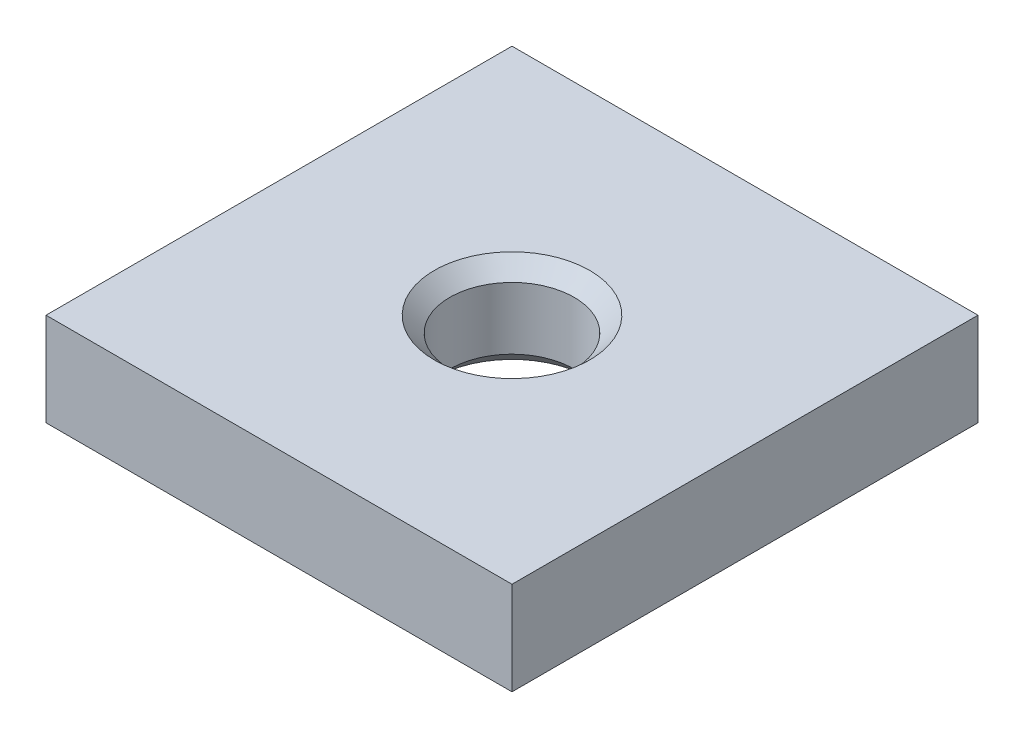
ISO-10303-21;
HEADER;
FILE_DESCRIPTION(('STEP AP214'),'2;1');
FILE_NAME('part.step','',(''),(''),'','','');
FILE_SCHEMA(('AUTOMOTIVE_DESIGN { 1 0 10303 214 1 1 1 1 }'));
ENDSEC;
DATA;
#1=APPLICATION_CONTEXT('core data for automotive mechanical design processes');
#2=APPLICATION_PROTOCOL_DEFINITION('international standard','automotive_design',2000,#1);
#3=PRODUCT_CONTEXT('',#1,'mechanical');
#4=PRODUCT('Part','Part','',(#3));
#5=PRODUCT_RELATED_PRODUCT_CATEGORY('part','',(#4));
#6=PRODUCT_DEFINITION_FORMATION('','',#4);
#7=PRODUCT_DEFINITION_CONTEXT('part definition',#1,'design');
#8=PRODUCT_DEFINITION('design','',#6,#7);
#9=PRODUCT_DEFINITION_SHAPE('','',#8);
#10=(LENGTH_UNIT() NAMED_UNIT(*) SI_UNIT(.MILLI.,.METRE.));
#11=(NAMED_UNIT(*) PLANE_ANGLE_UNIT() SI_UNIT($,.RADIAN.));
#12=(NAMED_UNIT(*) SI_UNIT($,.STERADIAN.) SOLID_ANGLE_UNIT());
#13=UNCERTAINTY_MEASURE_WITH_UNIT(LENGTH_MEASURE(1.E-05),#10,'distance_accuracy_value','');
#14=(GEOMETRIC_REPRESENTATION_CONTEXT(3) GLOBAL_UNCERTAINTY_ASSIGNED_CONTEXT((#13)) GLOBAL_UNIT_ASSIGNED_CONTEXT((#10,
#11,#12)) REPRESENTATION_CONTEXT('',''));
#15=CARTESIAN_POINT('',(0.,0.,0.));
#16=DIRECTION('',(0.,0.,1.));
#17=DIRECTION('',(1.,0.,0.));
#18=AXIS2_PLACEMENT_3D('',#15,#16,#17);
#19=CARTESIAN_POINT('',(-7.5,1.5,-7.5));
#20=DIRECTION('',(1.,0.,0.));
#21=DIRECTION('',(0.,0.,-1.));
#22=AXIS2_PLACEMENT_3D('',#19,#20,#21);
#23=PLANE('',#22);
#24=DIRECTION('',(0.,0.,1.));
#25=VECTOR('',#24,1.);
#26=CARTESIAN_POINT('',(-7.5,-1.5,-7.5));
#27=LINE('',#26,#25);
#28=CARTESIAN_POINT('',(-7.5,-1.5,-7.5));
#29=VERTEX_POINT('',#28);
#30=CARTESIAN_POINT('',(-7.5,-1.5,7.5));
#31=VERTEX_POINT('',#30);
#32=EDGE_CURVE('E84',#29,#31,#27,.T.);
#33=ORIENTED_EDGE('',*,*,#32,.T.);
#34=DIRECTION('',(0.,-1.,0.));
#35=VECTOR('',#34,1.);
#36=CARTESIAN_POINT('',(-7.5,1.5,7.5));
#37=LINE('',#36,#35);
#38=CARTESIAN_POINT('',(-7.5,1.5,7.5));
#39=VERTEX_POINT('',#38);
#40=EDGE_CURVE('E75',#39,#31,#37,.T.);
#41=ORIENTED_EDGE('',*,*,#40,.F.);
#42=DIRECTION('',(0.,0.,1.));
#43=VECTOR('',#42,1.);
#44=CARTESIAN_POINT('',(-7.5,1.5,-7.5));
#45=LINE('',#44,#43);
#46=CARTESIAN_POINT('',(-7.5,1.5,-7.5));
#47=VERTEX_POINT('',#46);
#48=EDGE_CURVE('E69',#47,#39,#45,.T.);
#49=ORIENTED_EDGE('',*,*,#48,.F.);
#50=DIRECTION('',(0.,-1.,0.));
#51=VECTOR('',#50,1.);
#52=CARTESIAN_POINT('',(-7.5,1.5,-7.5));
#53=LINE('',#52,#51);
#54=EDGE_CURVE('E80',#47,#29,#53,.T.);
#55=ORIENTED_EDGE('',*,*,#54,.T.);
#56=EDGE_LOOP('',(#33,#41,#49,#55));
#57=FACE_BOUND('',#56,.T.);
#58=ADVANCED_FACE('F16',(#57),#23,.F.);
#59=CARTESIAN_POINT('',(-7.5,1.5,7.5));
#60=DIRECTION('',(0.,0.,-1.));
#61=DIRECTION('',(-1.,0.,0.));
#62=AXIS2_PLACEMENT_3D('',#59,#60,#61);
#63=PLANE('',#62);
#64=DIRECTION('',(1.,0.,0.));
#65=VECTOR('',#64,1.);
#66=CARTESIAN_POINT('',(-7.5,-1.5,7.5));
#67=LINE('',#66,#65);
#68=CARTESIAN_POINT('',(7.5,-1.5,7.5));
#69=VERTEX_POINT('',#68);
#70=EDGE_CURVE('E74',#31,#69,#67,.T.);
#71=ORIENTED_EDGE('',*,*,#70,.T.);
#72=DIRECTION('',(0.,-1.,0.));
#73=VECTOR('',#72,1.);
#74=CARTESIAN_POINT('',(7.5,1.5,7.5));
#75=LINE('',#74,#73);
#76=CARTESIAN_POINT('',(7.5,1.5,7.5));
#77=VERTEX_POINT('',#76);
#78=EDGE_CURVE('E72',#77,#69,#75,.T.);
#79=ORIENTED_EDGE('',*,*,#78,.F.);
#80=DIRECTION('',(1.,0.,0.));
#81=VECTOR('',#80,1.);
#82=CARTESIAN_POINT('',(-7.5,1.5,7.5));
#83=LINE('',#82,#81);
#84=EDGE_CURVE('E64',#39,#77,#83,.T.);
#85=ORIENTED_EDGE('',*,*,#84,.F.);
#86=ORIENTED_EDGE('',*,*,#40,.T.);
#87=EDGE_LOOP('',(#71,#79,#85,#86));
#88=FACE_BOUND('',#87,.T.);
#89=ADVANCED_FACE('F73',(#88),#63,.F.);
#90=CARTESIAN_POINT('',(7.5,1.5,-7.5));
#91=DIRECTION('',(-1.,0.,0.));
#92=DIRECTION('',(0.,0.,1.));
#93=AXIS2_PLACEMENT_3D('',#90,#91,#92);
#94=PLANE('',#93);
#95=DIRECTION('',(0.,0.,-1.));
#96=VECTOR('',#95,1.);
#97=CARTESIAN_POINT('',(7.5,-1.5,-7.5));
#98=LINE('',#97,#96);
#99=CARTESIAN_POINT('',(7.5,-1.5,-7.5));
#100=VERTEX_POINT('',#99);
#101=EDGE_CURVE('E50',#69,#100,#98,.T.);
#102=ORIENTED_EDGE('',*,*,#101,.T.);
#103=DIRECTION('',(0.,-1.,0.));
#104=VECTOR('',#103,1.);
#105=CARTESIAN_POINT('',(7.5,1.5,-7.5));
#106=LINE('',#105,#104);
#107=CARTESIAN_POINT('',(7.5,1.5,-7.5));
#108=VERTEX_POINT('',#107);
#109=EDGE_CURVE('E76',#108,#100,#106,.T.);
#110=ORIENTED_EDGE('',*,*,#109,.F.);
#111=DIRECTION('',(0.,0.,-1.));
#112=VECTOR('',#111,1.);
#113=CARTESIAN_POINT('',(7.5,1.5,-7.5));
#114=LINE('',#113,#112);
#115=EDGE_CURVE('E67',#77,#108,#114,.T.);
#116=ORIENTED_EDGE('',*,*,#115,.F.);
#117=ORIENTED_EDGE('',*,*,#78,.T.);
#118=EDGE_LOOP('',(#102,#110,#116,#117));
#119=FACE_BOUND('',#118,.T.);
#120=ADVANCED_FACE('F78',(#119),#94,.F.);
#121=CARTESIAN_POINT('',(-7.5,1.5,-7.5));
#122=DIRECTION('',(0.,0.,1.));
#123=DIRECTION('',(1.,0.,0.));
#124=AXIS2_PLACEMENT_3D('',#121,#122,#123);
#125=PLANE('',#124);
#126=DIRECTION('',(-1.,0.,0.));
#127=VECTOR('',#126,1.);
#128=CARTESIAN_POINT('',(-7.5,-1.5,-7.5));
#129=LINE('',#128,#127);
#130=EDGE_CURVE('E56',#100,#29,#129,.T.);
#131=ORIENTED_EDGE('',*,*,#130,.T.);
#132=ORIENTED_EDGE('',*,*,#54,.F.);
#133=DIRECTION('',(-1.,0.,0.));
#134=VECTOR('',#133,1.);
#135=CARTESIAN_POINT('',(-7.5,1.5,-7.5));
#136=LINE('',#135,#134);
#137=EDGE_CURVE('E33',#108,#47,#136,.T.);
#138=ORIENTED_EDGE('',*,*,#137,.F.);
#139=ORIENTED_EDGE('',*,*,#109,.T.);
#140=EDGE_LOOP('',(#131,#132,#138,#139));
#141=FACE_BOUND('',#140,.T.);
#142=ADVANCED_FACE('F115',(#141),#125,.F.);
#143=CARTESIAN_POINT('',(0.,1.5,0.));
#144=DIRECTION('',(0.,1.,0.));
#145=DIRECTION('',(0.,0.,1.));
#146=AXIS2_PLACEMENT_3D('',#143,#144,#145);
#147=PLANE('',#146);
#148=CARTESIAN_POINT('',(0.,1.5,0.));
#149=DIRECTION('',(0.,1.,0.));
#150=DIRECTION('',(0.,0.,1.));
#151=AXIS2_PLACEMENT_3D('',#148,#149,#150);
#152=CIRCLE('',#151,2.5);
#153=CARTESIAN_POINT('',(0.,1.5,2.5));
#154=VERTEX_POINT('',#153);
#155=EDGE_CURVE('E10',#154,#154,#152,.F.);
#156=ORIENTED_EDGE('',*,*,#155,.T.);
#157=EDGE_LOOP('',(#156));
#158=FACE_BOUND('',#157,.T.);
#159=ORIENTED_EDGE('',*,*,#48,.T.);
#160=ORIENTED_EDGE('',*,*,#84,.T.);
#161=ORIENTED_EDGE('',*,*,#115,.T.);
#162=ORIENTED_EDGE('',*,*,#137,.T.);
#163=EDGE_LOOP('',(#159,#160,#161,#162));
#164=FACE_BOUND('',#163,.T.);
#165=ADVANCED_FACE('F65',(#158,#164),#147,.T.);
#166=CARTESIAN_POINT('',(0.,-1.5,0.));
#167=DIRECTION('',(0.,1.,0.));
#168=DIRECTION('',(0.,0.,1.));
#169=AXIS2_PLACEMENT_3D('',#166,#167,#168);
#170=PLANE('',#169);
#171=CARTESIAN_POINT('',(0.,-1.5,0.));
#172=DIRECTION('',(0.,1.,0.));
#173=DIRECTION('',(0.,0.,1.));
#174=AXIS2_PLACEMENT_3D('',#171,#172,#173);
#175=CIRCLE('',#174,2.5);
#176=CARTESIAN_POINT('',(0.,-1.5,2.5));
#177=VERTEX_POINT('',#176);
#178=EDGE_CURVE('E93',#177,#177,#175,.T.);
#179=ORIENTED_EDGE('',*,*,#178,.T.);
#180=EDGE_LOOP('',(#179));
#181=FACE_BOUND('',#180,.T.);
#182=ORIENTED_EDGE('',*,*,#32,.F.);
#183=ORIENTED_EDGE('',*,*,#130,.F.);
#184=ORIENTED_EDGE('',*,*,#101,.F.);
#185=ORIENTED_EDGE('',*,*,#70,.F.);
#186=EDGE_LOOP('',(#182,#183,#184,#185));
#187=FACE_BOUND('',#186,.T.);
#188=ADVANCED_FACE('F109',(#181,#187),#170,.F.);
#189=CARTESIAN_POINT('',(0.,-1.5,0.));
#190=DIRECTION('',(0.,1.,0.));
#191=DIRECTION('',(0.,0.,1.));
#192=AXIS2_PLACEMENT_3D('',#189,#190,#191);
#193=CYLINDRICAL_SURFACE('',#192,2.);
#194=CARTESIAN_POINT('',(0.,-1.,0.));
#195=DIRECTION('',(0.,1.,0.));
#196=DIRECTION('',(0.,0.,1.));
#197=AXIS2_PLACEMENT_3D('',#194,#195,#196);
#198=CIRCLE('',#197,2.);
#199=CARTESIAN_POINT('',(0.,-1.,2.));
#200=VERTEX_POINT('',#199);
#201=EDGE_CURVE('E25',#200,#200,#198,.F.);
#202=ORIENTED_EDGE('',*,*,#201,.T.);
#203=EDGE_LOOP('',(#202));
#204=FACE_BOUND('',#203,.T.);
#205=CARTESIAN_POINT('',(0.,1.00000000000001,0.));
#206=DIRECTION('',(0.,1.,0.));
#207=DIRECTION('',(0.,0.,1.));
#208=AXIS2_PLACEMENT_3D('',#205,#206,#207);
#209=CIRCLE('',#208,2.);
#210=CARTESIAN_POINT('',(0.,1.00000000000001,2.));
#211=VERTEX_POINT('',#210);
#212=EDGE_CURVE('E96',#211,#211,#209,.T.);
#213=ORIENTED_EDGE('',*,*,#212,.T.);
#214=EDGE_LOOP('',(#213));
#215=FACE_BOUND('',#214,.T.);
#216=ADVANCED_FACE('F101',(#204,#215),#193,.F.);
#217=CARTESIAN_POINT('',(0.,-1.5,0.));
#218=DIRECTION('',(0.,-1.,0.));
#219=DIRECTION('',(0.,0.,-1.));
#220=AXIS2_PLACEMENT_3D('',#217,#218,#219);
#221=CONICAL_SURFACE('',#220,2.5,0.785398163397448);
#222=ORIENTED_EDGE('',*,*,#201,.F.);
#223=EDGE_LOOP('',(#222));
#224=FACE_BOUND('',#223,.T.);
#225=ORIENTED_EDGE('',*,*,#178,.F.);
#226=EDGE_LOOP('',(#225));
#227=FACE_BOUND('',#226,.T.);
#228=ADVANCED_FACE('F104',(#224,#227),#221,.F.);
#229=CARTESIAN_POINT('',(0.,1.00000000000001,0.));
#230=DIRECTION('',(0.,1.,0.));
#231=DIRECTION('',(0.,0.,1.));
#232=AXIS2_PLACEMENT_3D('',#229,#230,#231);
#233=CONICAL_SURFACE('',#232,2.,0.785398163397452);
#234=ORIENTED_EDGE('',*,*,#155,.F.);
#235=EDGE_LOOP('',(#234));
#236=FACE_BOUND('',#235,.T.);
#237=ORIENTED_EDGE('',*,*,#212,.F.);
#238=EDGE_LOOP('',(#237));
#239=FACE_BOUND('',#238,.T.);
#240=ADVANCED_FACE('F18',(#236,#239),#233,.F.);
#241=CLOSED_SHELL('',(#58,#89,#120,#142,#165,#188,#216,#228,#240));
#242=MANIFOLD_SOLID_BREP('B1',#241);
#243=ADVANCED_BREP_SHAPE_REPRESENTATION('',(#18,#242),#14);
#244=SHAPE_DEFINITION_REPRESENTATION(#9,#243);
ENDSEC;
END-ISO-10303-21;
